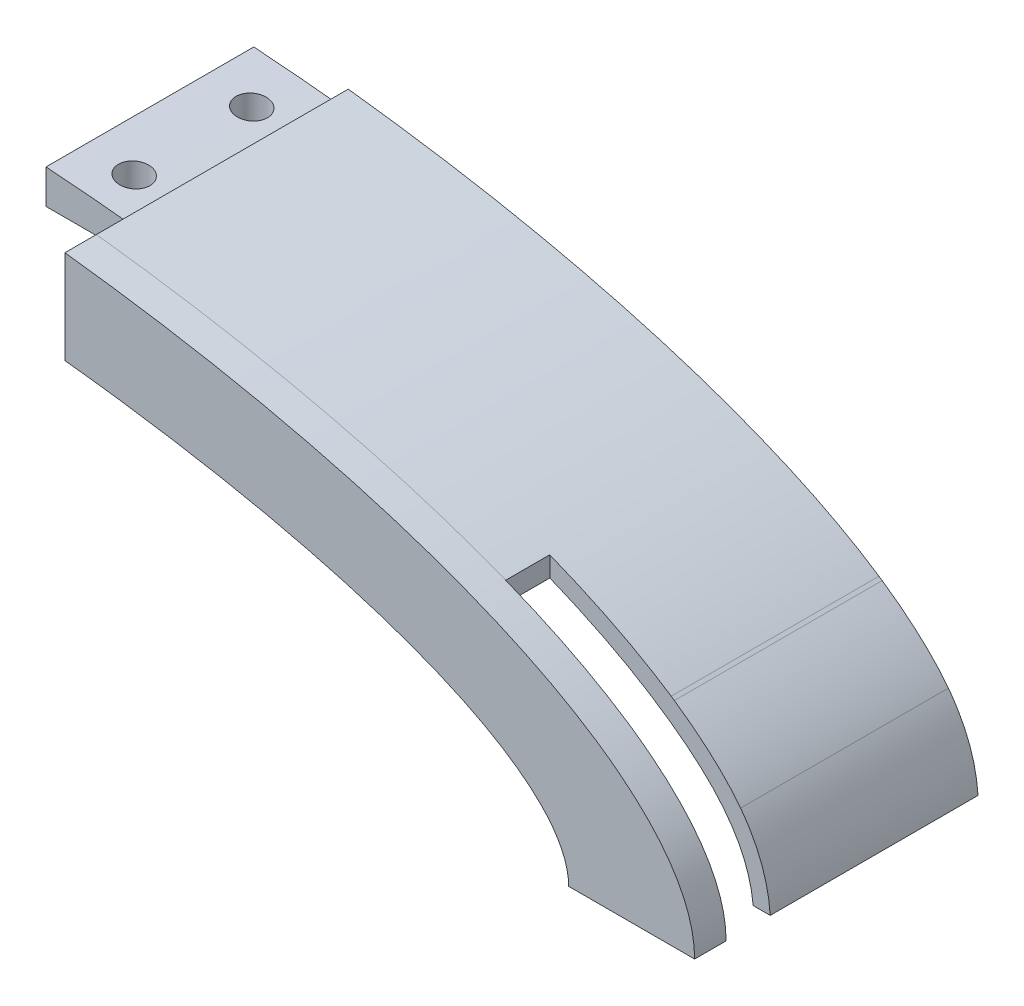
ISO-10303-21;
HEADER;
FILE_DESCRIPTION(('STEP AP214'),'2;1');
FILE_NAME('part.step','',(''),(''),'','','');
FILE_SCHEMA(('AUTOMOTIVE_DESIGN { 1 0 10303 214 1 1 1 1 }'));
ENDSEC;
DATA;
#1=APPLICATION_CONTEXT('core data for automotive mechanical design processes');
#2=APPLICATION_PROTOCOL_DEFINITION('international standard','automotive_design',2000,#1);
#3=PRODUCT_CONTEXT('',#1,'mechanical');
#4=PRODUCT('Part','Part','',(#3));
#5=PRODUCT_RELATED_PRODUCT_CATEGORY('part','',(#4));
#6=PRODUCT_DEFINITION_FORMATION('','',#4);
#7=PRODUCT_DEFINITION_CONTEXT('part definition',#1,'design');
#8=PRODUCT_DEFINITION('design','',#6,#7);
#9=PRODUCT_DEFINITION_SHAPE('','',#8);
#10=(LENGTH_UNIT() NAMED_UNIT(*) SI_UNIT(.MILLI.,.METRE.));
#11=(NAMED_UNIT(*) PLANE_ANGLE_UNIT() SI_UNIT($,.RADIAN.));
#12=(NAMED_UNIT(*) SI_UNIT($,.STERADIAN.) SOLID_ANGLE_UNIT());
#13=UNCERTAINTY_MEASURE_WITH_UNIT(LENGTH_MEASURE(1.E-05),#10,'distance_accuracy_value','');
#14=(GEOMETRIC_REPRESENTATION_CONTEXT(3) GLOBAL_UNCERTAINTY_ASSIGNED_CONTEXT((#13)) GLOBAL_UNIT_ASSIGNED_CONTEXT((#10,
#11,#12)) REPRESENTATION_CONTEXT('',''));
#15=CARTESIAN_POINT('',(0.,0.,0.));
#16=DIRECTION('',(0.,0.,1.));
#17=DIRECTION('',(1.,0.,0.));
#18=AXIS2_PLACEMENT_3D('',#15,#16,#17);
#19=CARTESIAN_POINT('',(50.,0.,0.));
#20=DIRECTION('',(-1.,0.,0.));
#21=DIRECTION('',(0.,-1.,0.));
#22=AXIS2_PLACEMENT_3D('',#19,#20,#21);
#23=PLANE('',#22);
#24=DIRECTION('',(0.,-1.,0.));
#25=VECTOR('',#24,1.);
#26=CARTESIAN_POINT('',(50.,0.,0.));
#27=LINE('',#26,#25);
#28=CARTESIAN_POINT('',(50.0000000000001,44.0928528927283,0.));
#29=VERTEX_POINT('',#28);
#30=CARTESIAN_POINT('',(50.,32.3076923076923,0.));
#31=VERTEX_POINT('',#30);
#32=EDGE_CURVE('E387',#29,#31,#27,.T.);
#33=ORIENTED_EDGE('',*,*,#32,.T.);
#34=DIRECTION('',(0.,0.,1.));
#35=VECTOR('',#34,1.);
#36=CARTESIAN_POINT('',(50.,32.3076923076923,2.5));
#37=LINE('',#36,#35);
#38=CARTESIAN_POINT('',(50.,32.3076923076923,5.));
#39=VERTEX_POINT('',#38);
#40=EDGE_CURVE('E384',#31,#39,#37,.T.);
#41=ORIENTED_EDGE('',*,*,#40,.T.);
#42=DIRECTION('',(0.,-1.,0.));
#43=VECTOR('',#42,1.);
#44=CARTESIAN_POINT('',(50.,0.,5.));
#45=LINE('',#44,#43);
#46=CARTESIAN_POINT('',(50.,47.1404520791032,5.));
#47=VERTEX_POINT('',#46);
#48=EDGE_CURVE('E400',#47,#39,#45,.T.);
#49=ORIENTED_EDGE('',*,*,#48,.F.);
#50=DIRECTION('',(0.,0.,-1.));
#51=VECTOR('',#50,1.);
#52=CARTESIAN_POINT('',(50.,47.1404520791032,5.));
#53=LINE('',#52,#51);
#54=CARTESIAN_POINT('',(50.,47.1404520791032,0.));
#55=VERTEX_POINT('',#54);
#56=EDGE_CURVE('E390',#47,#55,#53,.T.);
#57=ORIENTED_EDGE('',*,*,#56,.T.);
#58=DIRECTION('',(0.,0.,1.));
#59=VECTOR('',#58,1.);
#60=CARTESIAN_POINT('',(50.,47.1404520791032,-40.));
#61=LINE('',#60,#59);
#62=CARTESIAN_POINT('',(50.,47.1404520791032,-40.));
#63=VERTEX_POINT('',#62);
#64=EDGE_CURVE('E397',#55,#63,#61,.F.);
#65=ORIENTED_EDGE('',*,*,#64,.T.);
#66=DIRECTION('',(0.,-1.,0.));
#67=VECTOR('',#66,1.);
#68=CARTESIAN_POINT('',(50.,0.,-40.));
#69=LINE('',#68,#67);
#70=CARTESIAN_POINT('',(50.0000000000001,44.0928528927283,-40.));
#71=VERTEX_POINT('',#70);
#72=EDGE_CURVE('E381',#63,#71,#69,.T.);
#73=ORIENTED_EDGE('',*,*,#72,.T.);
#74=DIRECTION('',(0.,0.,1.));
#75=VECTOR('',#74,1.);
#76=CARTESIAN_POINT('',(50.,44.0928528927283,-40.));
#77=LINE('',#76,#75);
#78=CARTESIAN_POINT('',(50.0000000000001,44.0928528927283,-7.00000000000002));
#79=VERTEX_POINT('',#78);
#80=EDGE_CURVE('E394',#71,#79,#77,.T.);
#81=ORIENTED_EDGE('',*,*,#80,.T.);
#82=EDGE_CURVE('E393',#79,#29,#77,.T.);
#83=ORIENTED_EDGE('',*,*,#82,.T.);
#84=EDGE_LOOP('',(#33,#41,#49,#57,#65,#73,#81,#83));
#85=FACE_BOUND('',#84,.T.);
#86=ADVANCED_FACE('F39',(#85),#23,.T.);
#87=CARTESIAN_POINT('',(150.,50.0005,-7.));
#88=DIRECTION('',(0.,0.,1.));
#89=DIRECTION('',(1.,0.,0.));
#90=AXIS2_PLACEMENT_3D('',#87,#88,#89);
#91=PLANE('',#90);
#92=CARTESIAN_POINT('',(0.,0.,-7.00000000000001));
#93=DIRECTION('',(0.,0.,-1.));
#94=DIRECTION('',(-1.,0.,0.));
#95=AXIS2_PLACEMENT_3D('',#92,#93,#94);
#96=ELLIPSE('',#95,150.,50.);
#97=CARTESIAN_POINT('',(134.274226106668,22.2870969233956,-7.00000000000002));
#98=VERTEX_POINT('',#97);
#99=CARTESIAN_POINT('',(115.,32.1022671404304,-7.));
#100=VERTEX_POINT('',#99);
#101=EDGE_CURVE('E436',#98,#100,#96,.F.);
#102=ORIENTED_EDGE('',*,*,#101,.T.);
#103=DIRECTION('',(0.,-1.,0.));
#104=VECTOR('',#103,1.);
#105=CARTESIAN_POINT('',(115.,50.0005,-7.));
#106=LINE('',#105,#104);
#107=CARTESIAN_POINT('',(115.,28.8998222705045,-7.));
#108=VERTEX_POINT('',#107);
#109=EDGE_CURVE('E326',#100,#108,#106,.T.);
#110=ORIENTED_EDGE('',*,*,#109,.T.);
#111=CARTESIAN_POINT('',(147.297229877736,0.,-7.00000000000002));
#112=CARTESIAN_POINT('',(146.55190637035,8.1210873517637,-7.00000000000002));
#113=CARTESIAN_POINT('',(134.103124610867,20.5937570390856,-7.00000000000002));
#114=CARTESIAN_POINT('',(110.28433455085,31.4682746566878,-7.00000000000002));
#115=CARTESIAN_POINT('',(65.5548375328861,44.1559680318761,-7.00000000000002));
#116=CARTESIAN_POINT('',(27.8686299807415,46.563681344994,-7.00000000000002));
#117=CARTESIAN_POINT('',(0.,46.6002426808814,-7.00000000000002));
#118=B_SPLINE_CURVE_WITH_KNOTS('',3,(#111,#112,#113,#114,#115,#116,#117),.UNSPECIFIED.,.F.,.F.,
(4,1,1,1,4),(0.,0.141743179969019,0.308701525327165,0.483121699978807,1.),.UNSPECIFIED.);
#119=CARTESIAN_POINT('',(147.297229877736,0.,-7.));
#120=VERTEX_POINT('',#119);
#121=EDGE_CURVE('E306',#108,#120,#118,.F.);
#122=ORIENTED_EDGE('',*,*,#121,.T.);
#123=DIRECTION('',(-1.,0.,0.));
#124=VECTOR('',#123,1.);
#125=CARTESIAN_POINT('',(150.,0.,-7.));
#126=LINE('',#125,#124);
#127=CARTESIAN_POINT('',(150.,0.,-7.));
#128=VERTEX_POINT('',#127);
#129=EDGE_CURVE('E11',#128,#120,#126,.T.);
#130=ORIENTED_EDGE('',*,*,#129,.F.);
#131=CARTESIAN_POINT('',(150.,0.,-7.00000000000002));
#132=CARTESIAN_POINT('',(149.366974801961,10.0364415380543,-7.00000000000002));
#133=CARTESIAN_POINT('',(134.490815562498,24.4032961206006,-7.00000000000002));
#134=CARTESIAN_POINT('',(108.511776452667,35.2074679810045,-7.00000000000002));
#135=CARTESIAN_POINT('',(63.6543444537667,47.1037533474138,-7.00000000000002));
#136=CARTESIAN_POINT('',(27.5396604460598,49.9400050182537,-7.00000000000002));
#137=CARTESIAN_POINT('',(5.28874849839181E-13,50.,-7.00000000000002));
#138=B_SPLINE_CURVE_WITH_KNOTS('',3,(#131,#132,#133,#134,#135,#136,#137),.UNSPECIFIED.,.F.,.F.,
(4,1,1,1,4),(0.,0.164934741661339,0.354369831819262,0.50328897730762,1.),.UNSPECIFIED.);
#139=CARTESIAN_POINT('',(145.300907362266,12.4170416932275,-7.00000000000002));
#140=VERTEX_POINT('',#139);
#141=EDGE_CURVE('E301',#140,#128,#138,.F.);
#142=ORIENTED_EDGE('',*,*,#141,.F.);
#143=CARTESIAN_POINT('',(0.,0.,-7.00000000000001));
#144=DIRECTION('',(0.,0.,-1.));
#145=DIRECTION('',(-1.,0.,0.));
#146=AXIS2_PLACEMENT_3D('',#143,#144,#145);
#147=ELLIPSE('',#146,150.,50.);
#148=CARTESIAN_POINT('',(134.779349014432,21.9457084623899,-7.00000000000001));
#149=VERTEX_POINT('',#148);
#150=EDGE_CURVE('E305',#140,#149,#147,.F.);
#151=ORIENTED_EDGE('',*,*,#150,.T.);
#152=CARTESIAN_POINT('',(150.,0.,-7.00000000000002));
#153=CARTESIAN_POINT('',(149.366974801961,10.0364415380543,-7.00000000000002));
#154=CARTESIAN_POINT('',(134.490815562498,24.4032961206006,-7.00000000000002));
#155=CARTESIAN_POINT('',(108.511776452667,35.2074679810045,-7.00000000000002));
#156=CARTESIAN_POINT('',(63.6543444537667,47.1037533474138,-7.00000000000002));
#157=CARTESIAN_POINT('',(27.5396604460598,49.9400050182537,-7.00000000000002));
#158=CARTESIAN_POINT('',(5.28874849839181E-13,50.,-7.00000000000002));
#159=B_SPLINE_CURVE_WITH_KNOTS('',3,(#152,#153,#154,#155,#156,#157,#158),.UNSPECIFIED.,.F.,.F.,
(4,1,1,1,4),(0.,0.164934741661339,0.354369831819262,0.50328897730762,1.),.UNSPECIFIED.);
#160=EDGE_CURVE('E437',#98,#149,#159,.F.);
#161=ORIENTED_EDGE('',*,*,#160,.F.);
#162=EDGE_LOOP('',(#102,#110,#122,#130,#142,#151,#161));
#163=FACE_BOUND('',#162,.T.);
#164=ADVANCED_FACE('F253',(#163),#91,.T.);
#165=CARTESIAN_POINT('',(115.,50.0005,0.));
#166=DIRECTION('',(-1.,0.,0.));
#167=DIRECTION('',(0.,0.,1.));
#168=AXIS2_PLACEMENT_3D('',#165,#166,#167);
#169=PLANE('',#168);
#170=DIRECTION('',(0.,-1.,0.));
#171=VECTOR('',#170,1.);
#172=CARTESIAN_POINT('',(115.,50.0005,0.));
#173=LINE('',#172,#171);
#174=CARTESIAN_POINT('',(115.,32.1022671404304,0.));
#175=VERTEX_POINT('',#174);
#176=CARTESIAN_POINT('',(115.,28.8998222694203,0.));
#177=VERTEX_POINT('',#176);
#178=EDGE_CURVE('E49',#175,#177,#173,.T.);
#179=ORIENTED_EDGE('',*,*,#178,.T.);
#180=DIRECTION('',(0.,0.,1.));
#181=VECTOR('',#180,1.);
#182=CARTESIAN_POINT('',(115.,28.8998222705045,-40.));
#183=LINE('',#182,#181);
#184=EDGE_CURVE('E470',#108,#177,#183,.T.);
#185=ORIENTED_EDGE('',*,*,#184,.F.);
#186=ORIENTED_EDGE('',*,*,#109,.F.);
#187=DIRECTION('',(0.,0.,1.));
#188=VECTOR('',#187,1.);
#189=CARTESIAN_POINT('',(115.,32.1022671404304,-40.));
#190=LINE('',#189,#188);
#191=EDGE_CURVE('E304',#175,#100,#190,.F.);
#192=ORIENTED_EDGE('',*,*,#191,.F.);
#193=EDGE_LOOP('',(#179,#185,#186,#192));
#194=FACE_BOUND('',#193,.T.);
#195=ADVANCED_FACE('F255',(#194),#169,.F.);
#196=CARTESIAN_POINT('',(147.297229877736,0.,-40.));
#197=CARTESIAN_POINT('',(146.55190637035,8.1210873517637,-40.));
#198=CARTESIAN_POINT('',(134.103124610867,20.5937570390856,-40.));
#199=CARTESIAN_POINT('',(110.28433455085,31.4682746566878,-40.));
#200=CARTESIAN_POINT('',(65.5548375328861,44.1559680318761,-40.));
#201=CARTESIAN_POINT('',(27.8686299807415,46.563681344994,-40.));
#202=CARTESIAN_POINT('',(0.,46.6002426808814,-40.));
#203=B_SPLINE_CURVE_WITH_KNOTS('',3,(#196,#197,#198,#199,#200,#201,#202),.UNSPECIFIED.,.F.,.F.,
(4,1,1,1,4),(0.,0.141743179969019,0.308701525327165,0.483121699978807,1.),.UNSPECIFIED.);
#204=DIRECTION('',(0.,0.,1.));
#205=VECTOR('',#204,1.);
#206=SURFACE_OF_LINEAR_EXTRUSION('',#203,#205);
#207=ORIENTED_EDGE('',*,*,#82,.F.);
#208=CARTESIAN_POINT('',(147.297229877736,0.,-7.00000000000002));
#209=CARTESIAN_POINT('',(146.55190637035,8.1210873517637,-7.00000000000002));
#210=CARTESIAN_POINT('',(134.103124610867,20.5937570390856,-7.00000000000002));
#211=CARTESIAN_POINT('',(110.28433455085,31.4682746566878,-7.00000000000002));
#212=CARTESIAN_POINT('',(65.5548375328861,44.1559680318761,-7.00000000000002));
#213=CARTESIAN_POINT('',(27.8686299807415,46.563681344994,-7.00000000000002));
#214=CARTESIAN_POINT('',(0.,46.6002426808814,-7.00000000000002));
#215=B_SPLINE_CURVE_WITH_KNOTS('',3,(#208,#209,#210,#211,#212,#213,#214),.UNSPECIFIED.,.F.,.F.,
(4,1,1,1,4),(0.,0.141743179969019,0.308701525327165,0.483121699978807,1.),.UNSPECIFIED.);
#216=CARTESIAN_POINT('',(65.0000000000011,42.0902168247644,-7.00000000000002));
#217=VERTEX_POINT('',#216);
#218=EDGE_CURVE('E213',#217,#79,#215,.T.);
#219=ORIENTED_EDGE('',*,*,#218,.F.);
#220=DIRECTION('',(0.,0.,1.));
#221=VECTOR('',#220,1.);
#222=CARTESIAN_POINT('',(65.,42.0902168247645,-40.));
#223=LINE('',#222,#221);
#224=CARTESIAN_POINT('',(65.0000000000011,42.0902168247644,-40.));
#225=VERTEX_POINT('',#224);
#226=EDGE_CURVE('E178',#225,#217,#223,.T.);
#227=ORIENTED_EDGE('',*,*,#226,.F.);
#228=CARTESIAN_POINT('',(147.297229877736,0.,-40.));
#229=VERTEX_POINT('',#228);
#230=EDGE_CURVE('E334',#229,#225,#203,.T.);
#231=ORIENTED_EDGE('',*,*,#230,.F.);
#232=DIRECTION('',(0.,0.,1.));
#233=VECTOR('',#232,1.);
#234=CARTESIAN_POINT('',(147.297229877736,0.,-40.));
#235=LINE('',#234,#233);
#236=EDGE_CURVE('E424',#229,#120,#235,.T.);
#237=ORIENTED_EDGE('',*,*,#236,.T.);
#238=ORIENTED_EDGE('',*,*,#121,.F.);
#239=ORIENTED_EDGE('',*,*,#184,.T.);
#240=CARTESIAN_POINT('',(147.297229877736,0.,0.));
#241=CARTESIAN_POINT('',(146.55190637035,8.1210873517637,0.));
#242=CARTESIAN_POINT('',(134.103124610867,20.5937570390856,0.));
#243=CARTESIAN_POINT('',(110.28433455085,31.4682746566878,0.));
#244=CARTESIAN_POINT('',(65.5548375328861,44.1559680318761,0.));
#245=CARTESIAN_POINT('',(27.8686299807415,46.563681344994,0.));
#246=CARTESIAN_POINT('',(0.,46.6002426808814,0.));
#247=B_SPLINE_CURVE_WITH_KNOTS('',3,(#240,#241,#242,#243,#244,#245,#246),.UNSPECIFIED.,.F.,.F.,
(4,1,1,1,4),(0.,0.141743179969019,0.308701525327165,0.483121699978807,1.),.UNSPECIFIED.);
#248=EDGE_CURVE('E433',#177,#29,#247,.T.);
#249=ORIENTED_EDGE('',*,*,#248,.T.);
#250=EDGE_LOOP('',(#207,#219,#227,#231,#237,#238,#239,#249));
#251=FACE_BOUND('',#250,.T.);
#252=ADVANCED_FACE('F261',(#251),#206,.F.);
#253=CARTESIAN_POINT('',(-172.714644282662,0.,-343.285055293836));
#254=DIRECTION('',(0.,1.,0.));
#255=DIRECTION('',(0.,0.,1.));
#256=AXIS2_PLACEMENT_3D('',#253,#254,#255);
#257=PLANE('',#256);
#258=ORIENTED_EDGE('',*,*,#129,.T.);
#259=ORIENTED_EDGE('',*,*,#236,.F.);
#260=DIRECTION('',(-1.,0.,0.));
#261=VECTOR('',#260,1.);
#262=CARTESIAN_POINT('',(0.,0.,-40.));
#263=LINE('',#262,#261);
#264=CARTESIAN_POINT('',(150.,0.,-40.));
#265=VERTEX_POINT('',#264);
#266=EDGE_CURVE('E369',#265,#229,#263,.T.);
#267=ORIENTED_EDGE('',*,*,#266,.F.);
#268=DIRECTION('',(0.,0.,1.));
#269=VECTOR('',#268,1.);
#270=CARTESIAN_POINT('',(150.,0.,-40.));
#271=LINE('',#270,#269);
#272=EDGE_CURVE('E341',#265,#128,#271,.T.);
#273=ORIENTED_EDGE('',*,*,#272,.T.);
#274=EDGE_LOOP('',(#258,#259,#267,#273));
#275=FACE_BOUND('',#274,.T.);
#276=ADVANCED_FACE('F268',(#275),#257,.F.);
#277=CARTESIAN_POINT('',(150.,0.,-40.));
#278=CARTESIAN_POINT('',(149.366974801961,10.0364415380543,-40.));
#279=CARTESIAN_POINT('',(134.490815562498,24.4032961206006,-40.));
#280=CARTESIAN_POINT('',(108.511776452667,35.2074679810045,-40.));
#281=CARTESIAN_POINT('',(63.6543444537667,47.1037533474138,-40.));
#282=CARTESIAN_POINT('',(27.5396604460598,49.9400050182537,-40.));
#283=CARTESIAN_POINT('',(5.28874849839181E-13,50.,-40.));
#284=B_SPLINE_CURVE_WITH_KNOTS('',3,(#277,#278,#279,#280,#281,#282,#283),.UNSPECIFIED.,.F.,.F.,
(4,1,1,1,4),(0.,0.164934741661339,0.354369831819262,0.50328897730762,1.),.UNSPECIFIED.);
#285=DIRECTION('',(0.,0.,1.));
#286=VECTOR('',#285,1.);
#287=SURFACE_OF_LINEAR_EXTRUSION('',#284,#286);
#288=DIRECTION('',(0.,0.,1.));
#289=VECTOR('',#288,1.);
#290=CARTESIAN_POINT('',(145.300907362266,12.4170416932275,-40.));
#291=LINE('',#290,#289);
#292=CARTESIAN_POINT('',(145.300907362266,12.4170416932275,-40.));
#293=VERTEX_POINT('',#292);
#294=EDGE_CURVE('E451',#293,#140,#291,.T.);
#295=ORIENTED_EDGE('',*,*,#294,.T.);
#296=ORIENTED_EDGE('',*,*,#141,.T.);
#297=ORIENTED_EDGE('',*,*,#272,.F.);
#298=EDGE_CURVE('E363',#265,#293,#284,.T.);
#299=ORIENTED_EDGE('',*,*,#298,.T.);
#300=EDGE_LOOP('',(#295,#296,#297,#299));
#301=FACE_BOUND('',#300,.T.);
#302=ADVANCED_FACE('F270',(#301),#287,.T.);
#303=CARTESIAN_POINT('',(0.,0.,-40.));
#304=DIRECTION('',(0.,0.,-1.));
#305=DIRECTION('',(-1.,0.,0.));
#306=AXIS2_PLACEMENT_3D('',#303,#304,#305);
#307=ELLIPSE('',#306,150.,50.);
#308=DIRECTION('',(0.,0.,1.));
#309=VECTOR('',#308,1.);
#310=SURFACE_OF_LINEAR_EXTRUSION('',#307,#309);
#311=ORIENTED_EDGE('',*,*,#150,.F.);
#312=ORIENTED_EDGE('',*,*,#294,.F.);
#313=CARTESIAN_POINT('',(134.779349014432,21.9457084623899,-40.));
#314=VERTEX_POINT('',#313);
#315=EDGE_CURVE('E342',#314,#293,#307,.T.);
#316=ORIENTED_EDGE('',*,*,#315,.F.);
#317=DIRECTION('',(0.,0.,1.));
#318=VECTOR('',#317,1.);
#319=CARTESIAN_POINT('',(134.779349014432,21.9457084623899,-40.));
#320=LINE('',#319,#318);
#321=EDGE_CURVE('E423',#314,#149,#320,.T.);
#322=ORIENTED_EDGE('',*,*,#321,.T.);
#323=EDGE_LOOP('',(#311,#312,#316,#322));
#324=FACE_BOUND('',#323,.T.);
#325=ADVANCED_FACE('F356',(#324),#310,.F.);
#326=DIRECTION('',(0.,0.,1.));
#327=VECTOR('',#326,1.);
#328=CARTESIAN_POINT('',(134.274226106668,22.2870969233957,-40.));
#329=LINE('',#328,#327);
#330=CARTESIAN_POINT('',(134.274226106668,22.2870969233957,-40.));
#331=VERTEX_POINT('',#330);
#332=EDGE_CURVE('E419',#331,#98,#329,.T.);
#333=ORIENTED_EDGE('',*,*,#332,.T.);
#334=ORIENTED_EDGE('',*,*,#160,.T.);
#335=ORIENTED_EDGE('',*,*,#321,.F.);
#336=EDGE_CURVE('E370',#314,#331,#284,.T.);
#337=ORIENTED_EDGE('',*,*,#336,.T.);
#338=EDGE_LOOP('',(#333,#334,#335,#337));
#339=FACE_BOUND('',#338,.T.);
#340=ADVANCED_FACE('F354',(#339),#287,.T.);
#341=ORIENTED_EDGE('',*,*,#64,.F.);
#342=CARTESIAN_POINT('',(0.,0.,0.));
#343=DIRECTION('',(0.,0.,-1.));
#344=DIRECTION('',(-1.,0.,0.));
#345=AXIS2_PLACEMENT_3D('',#342,#343,#344);
#346=ELLIPSE('',#345,150.,50.);
#347=EDGE_CURVE('E331',#55,#175,#346,.T.);
#348=ORIENTED_EDGE('',*,*,#347,.T.);
#349=ORIENTED_EDGE('',*,*,#191,.T.);
#350=ORIENTED_EDGE('',*,*,#101,.F.);
#351=ORIENTED_EDGE('',*,*,#332,.F.);
#352=EDGE_CURVE('E340',#63,#331,#307,.T.);
#353=ORIENTED_EDGE('',*,*,#352,.F.);
#354=EDGE_LOOP('',(#341,#348,#349,#350,#351,#353));
#355=FACE_BOUND('',#354,.T.);
#356=ADVANCED_FACE('F351',(#355),#310,.F.);
#357=CARTESIAN_POINT('',(0.,0.,-40.));
#358=DIRECTION('',(0.,0.,1.));
#359=DIRECTION('',(1.,0.,0.));
#360=AXIS2_PLACEMENT_3D('',#357,#358,#359);
#361=PLANE('',#360);
#362=ORIENTED_EDGE('',*,*,#72,.F.);
#363=ORIENTED_EDGE('',*,*,#352,.T.);
#364=ORIENTED_EDGE('',*,*,#336,.F.);
#365=ORIENTED_EDGE('',*,*,#315,.T.);
#366=ORIENTED_EDGE('',*,*,#298,.F.);
#367=ORIENTED_EDGE('',*,*,#266,.T.);
#368=ORIENTED_EDGE('',*,*,#230,.T.);
#369=DIRECTION('',(0.,-1.,0.));
#370=VECTOR('',#369,1.);
#371=CARTESIAN_POINT('',(65.,50.0015,-40.));
#372=LINE('',#371,#370);
#373=CARTESIAN_POINT('',(65.,40.,-40.));
#374=VERTEX_POINT('',#373);
#375=EDGE_CURVE('E207',#225,#374,#372,.T.);
#376=ORIENTED_EDGE('',*,*,#375,.T.);
#377=DIRECTION('',(-1.,0.,0.));
#378=VECTOR('',#377,1.);
#379=CARTESIAN_POINT('',(65.,40.,-40.));
#380=LINE('',#379,#378);
#381=CARTESIAN_POINT('',(35.,40.,-40.));
#382=VERTEX_POINT('',#381);
#383=EDGE_CURVE('E183',#374,#382,#380,.T.);
#384=ORIENTED_EDGE('',*,*,#383,.T.);
#385=DIRECTION('',(0.,-1.,0.));
#386=VECTOR('',#385,1.);
#387=CARTESIAN_POINT('',(35.,50.0015,-40.));
#388=LINE('',#387,#386);
#389=CARTESIAN_POINT('',(35.,45.4411229775928,-40.));
#390=VERTEX_POINT('',#389);
#391=EDGE_CURVE('E210',#390,#382,#388,.T.);
#392=ORIENTED_EDGE('',*,*,#391,.F.);
#393=CARTESIAN_POINT('',(147.297229877736,0.,-40.));
#394=CARTESIAN_POINT('',(146.55190637035,8.1210873517637,-40.));
#395=CARTESIAN_POINT('',(134.103124610867,20.5937570390856,-40.));
#396=CARTESIAN_POINT('',(110.28433455085,31.4682746566878,-40.));
#397=CARTESIAN_POINT('',(65.5548375328861,44.1559680318761,-40.));
#398=CARTESIAN_POINT('',(27.8686299807415,46.563681344994,-40.));
#399=CARTESIAN_POINT('',(0.,46.6002426808814,-40.));
#400=B_SPLINE_CURVE_WITH_KNOTS('',3,(#393,#394,#395,#396,#397,#398,#399),.UNSPECIFIED.,.F.,.F.,
(4,1,1,1,4),(0.,0.141743179969019,0.308701525327165,0.483121699978807,1.),.UNSPECIFIED.);
#401=EDGE_CURVE('E218',#71,#390,#400,.T.);
#402=ORIENTED_EDGE('',*,*,#401,.F.);
#403=EDGE_LOOP('',(#362,#363,#364,#365,#366,#367,#368,#376,#384,#392,#402));
#404=FACE_BOUND('',#403,.T.);
#405=ADVANCED_FACE('F278',(#404),#361,.F.);
#406=CARTESIAN_POINT('',(0.,0.,0.));
#407=DIRECTION('',(0.,0.,1.));
#408=DIRECTION('',(1.,0.,0.));
#409=AXIS2_PLACEMENT_3D('',#406,#407,#408);
#410=PLANE('',#409);
#411=ORIENTED_EDGE('',*,*,#32,.F.);
#412=ORIENTED_EDGE('',*,*,#248,.F.);
#413=ORIENTED_EDGE('',*,*,#178,.F.);
#414=CARTESIAN_POINT('',(0.,0.,0.));
#415=DIRECTION('',(0.,0.,-1.));
#416=DIRECTION('',(-1.,0.,0.));
#417=AXIS2_PLACEMENT_3D('',#414,#415,#416);
#418=ELLIPSE('',#417,150.,50.);
#419=CARTESIAN_POINT('',(134.274226106667,22.2870969233956,0.));
#420=VERTEX_POINT('',#419);
#421=EDGE_CURVE('E321',#420,#175,#418,.F.);
#422=ORIENTED_EDGE('',*,*,#421,.F.);
#423=CARTESIAN_POINT('',(0.,0.,0.));
#424=DIRECTION('',(0.,0.,1.));
#425=DIRECTION('',(1.,0.,0.));
#426=AXIS2_PLACEMENT_3D('',#423,#424,#425);
#427=ELLIPSE('',#426,150.,50.);
#428=CARTESIAN_POINT('',(134.779349014432,21.9457084623899,0.));
#429=VERTEX_POINT('',#428);
#430=EDGE_CURVE('E298',#429,#420,#427,.T.);
#431=ORIENTED_EDGE('',*,*,#430,.F.);
#432=CARTESIAN_POINT('',(0.,0.,0.));
#433=DIRECTION('',(0.,0.,1.));
#434=DIRECTION('',(1.,0.,0.));
#435=AXIS2_PLACEMENT_3D('',#432,#433,#434);
#436=ELLIPSE('',#435,150.,50.);
#437=CARTESIAN_POINT('',(150.,0.,0.));
#438=VERTEX_POINT('',#437);
#439=EDGE_CURVE('E380',#438,#429,#436,.T.);
#440=ORIENTED_EDGE('',*,*,#439,.F.);
#441=DIRECTION('',(1.,0.,0.));
#442=VECTOR('',#441,1.);
#443=CARTESIAN_POINT('',(-172.714644282662,0.,0.));
#444=LINE('',#443,#442);
#445=CARTESIAN_POINT('',(130.,0.,0.));
#446=VERTEX_POINT('',#445);
#447=EDGE_CURVE('E57',#446,#438,#444,.T.);
#448=ORIENTED_EDGE('',*,*,#447,.F.);
#449=CARTESIAN_POINT('',(0.,0.,0.));
#450=DIRECTION('',(0.,0.,1.));
#451=DIRECTION('',(1.,0.,0.));
#452=AXIS2_PLACEMENT_3D('',#449,#450,#451);
#453=ELLIPSE('',#452,130.,35.);
#454=EDGE_CURVE('E378',#31,#446,#453,.F.);
#455=ORIENTED_EDGE('',*,*,#454,.F.);
#456=EDGE_LOOP('',(#411,#412,#413,#422,#431,#440,#448,#455));
#457=FACE_BOUND('',#456,.T.);
#458=ADVANCED_FACE('F274',(#457),#410,.F.);
#459=ORIENTED_EDGE('',*,*,#447,.T.);
#460=DIRECTION('',(0.,0.,-1.));
#461=VECTOR('',#460,1.);
#462=CARTESIAN_POINT('',(150.,0.,5.));
#463=LINE('',#462,#461);
#464=CARTESIAN_POINT('',(150.,0.,5.));
#465=VERTEX_POINT('',#464);
#466=EDGE_CURVE('E377',#465,#438,#463,.T.);
#467=ORIENTED_EDGE('',*,*,#466,.F.);
#468=DIRECTION('',(-1.,0.,0.));
#469=VECTOR('',#468,1.);
#470=CARTESIAN_POINT('',(-172.714644282662,0.,5.));
#471=LINE('',#470,#469);
#472=CARTESIAN_POINT('',(130.,0.,5.));
#473=VERTEX_POINT('',#472);
#474=EDGE_CURVE('E330',#465,#473,#471,.T.);
#475=ORIENTED_EDGE('',*,*,#474,.T.);
#476=DIRECTION('',(0.,0.,1.));
#477=VECTOR('',#476,1.);
#478=CARTESIAN_POINT('',(130.,0.,2.5));
#479=LINE('',#478,#477);
#480=EDGE_CURVE('E414',#446,#473,#479,.T.);
#481=ORIENTED_EDGE('',*,*,#480,.F.);
#482=EDGE_LOOP('',(#459,#467,#475,#481));
#483=FACE_BOUND('',#482,.T.);
#484=ADVANCED_FACE('F272',(#483),#257,.F.);
#485=CARTESIAN_POINT('',(0.,0.,-269.258240356725));
#486=DIRECTION('',(0.,0.,1.));
#487=DIRECTION('',(1.,0.,0.));
#488=AXIS2_PLACEMENT_3D('',#485,#486,#487);
#489=ELLIPSE('',#488,130.,35.);
#490=DIRECTION('',(0.,0.,1.));
#491=VECTOR('',#490,1.);
#492=SURFACE_OF_LINEAR_EXTRUSION('',#489,#491);
#493=ORIENTED_EDGE('',*,*,#40,.F.);
#494=ORIENTED_EDGE('',*,*,#454,.T.);
#495=ORIENTED_EDGE('',*,*,#480,.T.);
#496=CARTESIAN_POINT('',(0.,0.,5.));
#497=DIRECTION('',(0.,0.,1.));
#498=DIRECTION('',(1.,0.,0.));
#499=AXIS2_PLACEMENT_3D('',#496,#497,#498);
#500=ELLIPSE('',#499,130.,35.);
#501=EDGE_CURVE('E371',#473,#39,#500,.T.);
#502=ORIENTED_EDGE('',*,*,#501,.T.);
#503=EDGE_LOOP('',(#493,#494,#495,#502));
#504=FACE_BOUND('',#503,.T.);
#505=ADVANCED_FACE('F280',(#504),#492,.F.);
#506=CARTESIAN_POINT('',(0.,0.,5.));
#507=DIRECTION('',(0.,0.,1.));
#508=DIRECTION('',(1.,0.,0.));
#509=AXIS2_PLACEMENT_3D('',#506,#507,#508);
#510=ELLIPSE('',#509,150.,50.);
#511=DIRECTION('',(0.,0.,-1.));
#512=VECTOR('',#511,1.);
#513=SURFACE_OF_LINEAR_EXTRUSION('',#510,#512);
#514=ORIENTED_EDGE('',*,*,#56,.F.);
#515=CARTESIAN_POINT('',(134.274226106553,22.2870969234726,5.));
#516=VERTEX_POINT('',#515);
#517=EDGE_CURVE('E413',#516,#47,#510,.T.);
#518=ORIENTED_EDGE('',*,*,#517,.F.);
#519=CARTESIAN_POINT('',(0.,0.,5.));
#520=DIRECTION('',(0.,0.,-1.));
#521=DIRECTION('',(1.,0.,0.));
#522=AXIS2_PLACEMENT_3D('',#519,#520,#521);
#523=ELLIPSE('',#522,150.,50.);
#524=CARTESIAN_POINT('',(134.779349014432,21.9457084623899,5.));
#525=VERTEX_POINT('',#524);
#526=EDGE_CURVE('E418',#525,#516,#523,.F.);
#527=ORIENTED_EDGE('',*,*,#526,.F.);
#528=EDGE_CURVE('E411',#465,#525,#510,.T.);
#529=ORIENTED_EDGE('',*,*,#528,.F.);
#530=ORIENTED_EDGE('',*,*,#466,.T.);
#531=ORIENTED_EDGE('',*,*,#439,.T.);
#532=ORIENTED_EDGE('',*,*,#430,.T.);
#533=ORIENTED_EDGE('',*,*,#421,.T.);
#534=ORIENTED_EDGE('',*,*,#347,.F.);
#535=EDGE_LOOP('',(#514,#518,#527,#529,#530,#531,#532,#533,#534));
#536=FACE_BOUND('',#535,.T.);
#537=ADVANCED_FACE('F360',(#536),#513,.F.);
#538=CARTESIAN_POINT('',(0.,0.,5.));
#539=DIRECTION('',(0.,0.,1.));
#540=DIRECTION('',(1.,0.,0.));
#541=AXIS2_PLACEMENT_3D('',#538,#539,#540);
#542=PLANE('',#541);
#543=ORIENTED_EDGE('',*,*,#517,.T.);
#544=ORIENTED_EDGE('',*,*,#48,.T.);
#545=ORIENTED_EDGE('',*,*,#501,.F.);
#546=ORIENTED_EDGE('',*,*,#474,.F.);
#547=ORIENTED_EDGE('',*,*,#528,.T.);
#548=ORIENTED_EDGE('',*,*,#526,.T.);
#549=EDGE_LOOP('',(#543,#544,#545,#546,#547,#548));
#550=FACE_BOUND('',#549,.T.);
#551=ADVANCED_FACE('F41',(#550),#542,.T.);
#552=CARTESIAN_POINT('',(0.,40.,0.));
#553=DIRECTION('',(0.,-1.,0.));
#554=DIRECTION('',(0.,0.,-1.));
#555=AXIS2_PLACEMENT_3D('',#552,#553,#554);
#556=PLANE('',#555);
#557=CARTESIAN_POINT('',(42.5,40.,-13.5));
#558=DIRECTION('',(0.,-1.,0.));
#559=DIRECTION('',(0.,0.,-1.));
#560=AXIS2_PLACEMENT_3D('',#557,#558,#559);
#561=CIRCLE('',#560,2.5);
#562=CARTESIAN_POINT('',(42.5,40.,-16.));
#563=VERTEX_POINT('',#562);
#564=EDGE_CURVE('E233',#563,#563,#561,.T.);
#565=ORIENTED_EDGE('',*,*,#564,.F.);
#566=EDGE_LOOP('',(#565));
#567=FACE_BOUND('',#566,.T.);
#568=CARTESIAN_POINT('',(42.5,40.,-32.1657372772675));
#569=DIRECTION('',(0.,-1.,0.));
#570=DIRECTION('',(0.,0.,-1.));
#571=AXIS2_PLACEMENT_3D('',#568,#569,#570);
#572=CIRCLE('',#571,2.5);
#573=CARTESIAN_POINT('',(42.5,40.,-34.6657372772675));
#574=VERTEX_POINT('',#573);
#575=EDGE_CURVE('E542',#574,#574,#572,.T.);
#576=ORIENTED_EDGE('',*,*,#575,.F.);
#577=EDGE_LOOP('',(#576));
#578=FACE_BOUND('',#577,.T.);
#579=DIRECTION('',(0.,0.,1.));
#580=VECTOR('',#579,1.);
#581=CARTESIAN_POINT('',(65.,40.,-40.));
#582=LINE('',#581,#580);
#583=CARTESIAN_POINT('',(65.,40.,-7.));
#584=VERTEX_POINT('',#583);
#585=EDGE_CURVE('E176',#374,#584,#582,.T.);
#586=ORIENTED_EDGE('',*,*,#585,.T.);
#587=DIRECTION('',(-1.,0.,0.));
#588=VECTOR('',#587,1.);
#589=CARTESIAN_POINT('',(65.,40.,-7.));
#590=LINE('',#589,#588);
#591=CARTESIAN_POINT('',(35.,40.,-7.));
#592=VERTEX_POINT('',#591);
#593=EDGE_CURVE('E186',#584,#592,#590,.T.);
#594=ORIENTED_EDGE('',*,*,#593,.T.);
#595=DIRECTION('',(0.,0.,1.));
#596=VECTOR('',#595,1.);
#597=CARTESIAN_POINT('',(35.,40.,-40.));
#598=LINE('',#597,#596);
#599=EDGE_CURVE('E192',#382,#592,#598,.T.);
#600=ORIENTED_EDGE('',*,*,#599,.F.);
#601=ORIENTED_EDGE('',*,*,#383,.F.);
#602=EDGE_LOOP('',(#586,#594,#600,#601));
#603=FACE_BOUND('',#602,.T.);
#604=ADVANCED_FACE('F195',(#567,#578,#603),#556,.T.);
#605=CARTESIAN_POINT('',(65.,50.0015,-7.));
#606=DIRECTION('',(0.,0.,1.));
#607=DIRECTION('',(1.,0.,0.));
#608=AXIS2_PLACEMENT_3D('',#605,#606,#607);
#609=PLANE('',#608);
#610=DIRECTION('',(0.,-1.,0.));
#611=VECTOR('',#610,1.);
#612=CARTESIAN_POINT('',(65.,50.0015,-7.));
#613=LINE('',#612,#611);
#614=EDGE_CURVE('E172',#217,#584,#613,.T.);
#615=ORIENTED_EDGE('',*,*,#614,.F.);
#616=ORIENTED_EDGE('',*,*,#218,.T.);
#617=CARTESIAN_POINT('',(35.,45.4411229775928,-7.));
#618=VERTEX_POINT('',#617);
#619=EDGE_CURVE('E209',#79,#618,#215,.T.);
#620=ORIENTED_EDGE('',*,*,#619,.T.);
#621=DIRECTION('',(0.,-1.,0.));
#622=VECTOR('',#621,1.);
#623=CARTESIAN_POINT('',(35.,50.0015,-7.));
#624=LINE('',#623,#622);
#625=EDGE_CURVE('E182',#618,#592,#624,.T.);
#626=ORIENTED_EDGE('',*,*,#625,.T.);
#627=ORIENTED_EDGE('',*,*,#593,.F.);
#628=EDGE_LOOP('',(#615,#616,#620,#626,#627));
#629=FACE_BOUND('',#628,.T.);
#630=ADVANCED_FACE('F187',(#629),#609,.T.);
#631=CARTESIAN_POINT('',(35.,50.0015,-40.));
#632=DIRECTION('',(1.,0.,0.));
#633=DIRECTION('',(0.,0.,-1.));
#634=AXIS2_PLACEMENT_3D('',#631,#632,#633);
#635=PLANE('',#634);
#636=DIRECTION('',(0.,0.,1.));
#637=VECTOR('',#636,1.);
#638=CARTESIAN_POINT('',(35.,45.4411229775928,-40.));
#639=LINE('',#638,#637);
#640=EDGE_CURVE('E217',#390,#618,#639,.T.);
#641=ORIENTED_EDGE('',*,*,#640,.F.);
#642=ORIENTED_EDGE('',*,*,#391,.T.);
#643=ORIENTED_EDGE('',*,*,#599,.T.);
#644=ORIENTED_EDGE('',*,*,#625,.F.);
#645=EDGE_LOOP('',(#641,#642,#643,#644));
#646=FACE_BOUND('',#645,.T.);
#647=ADVANCED_FACE('F523',(#646),#635,.F.);
#648=CARTESIAN_POINT('',(65.,50.0015,-40.));
#649=DIRECTION('',(1.,0.,0.));
#650=DIRECTION('',(0.,0.,-1.));
#651=AXIS2_PLACEMENT_3D('',#648,#649,#650);
#652=PLANE('',#651);
#653=ORIENTED_EDGE('',*,*,#375,.F.);
#654=ORIENTED_EDGE('',*,*,#226,.T.);
#655=ORIENTED_EDGE('',*,*,#614,.T.);
#656=ORIENTED_EDGE('',*,*,#585,.F.);
#657=EDGE_LOOP('',(#653,#654,#655,#656));
#658=FACE_BOUND('',#657,.T.);
#659=ADVANCED_FACE('F174',(#658),#652,.T.);
#660=CARTESIAN_POINT('',(147.297229877736,0.,-40.));
#661=CARTESIAN_POINT('',(146.55190637035,8.1210873517637,-40.));
#662=CARTESIAN_POINT('',(134.103124610867,20.5937570390856,-40.));
#663=CARTESIAN_POINT('',(110.28433455085,31.4682746566878,-40.));
#664=CARTESIAN_POINT('',(65.5548375328861,44.1559680318761,-40.));
#665=CARTESIAN_POINT('',(27.8686299807415,46.563681344994,-40.));
#666=CARTESIAN_POINT('',(0.,46.6002426808814,-40.));
#667=B_SPLINE_CURVE_WITH_KNOTS('',3,(#660,#661,#662,#663,#664,#665,#666),.UNSPECIFIED.,.F.,.F.,
(4,1,1,1,4),(0.,0.141743179969019,0.308701525327165,0.483121699978807,1.),.UNSPECIFIED.);
#668=DIRECTION('',(0.,0.,1.));
#669=VECTOR('',#668,1.);
#670=SURFACE_OF_LINEAR_EXTRUSION('',#667,#669);
#671=CARTESIAN_POINT('',(42.5,44.8421955681182,-16.));
#672=CARTESIAN_POINT('',(42.3592084155711,44.854810754203,-15.9999938328833));
#673=CARTESIAN_POINT('',(42.2183081408641,44.8673555728007,-15.9880675746695));
#674=CARTESIAN_POINT('',(41.9403662018676,44.8919482755418,-15.9406413046343));
#675=CARTESIAN_POINT('',(41.8033293574308,44.9039955469793,-15.9051130965354));
#676=CARTESIAN_POINT('',(41.5371741444046,44.927256146879,-15.8114610184666));
#677=CARTESIAN_POINT('',(41.4080528132948,44.9384697876806,-15.7533456626511));
#678=CARTESIAN_POINT('',(41.1614156893354,44.9597734126804,-15.6161527799869));
#679=CARTESIAN_POINT('',(41.043896939423,44.9698636832677,-15.5370806132703));
#680=CARTESIAN_POINT('',(40.824014043165,44.9886533526824,-15.3603568091622));
#681=CARTESIAN_POINT('',(40.7216217045855,44.9973553414388,-15.2627405306962));
#682=CARTESIAN_POINT('',(40.534682207297,45.0131800835056,-15.0515828693061));
#683=CARTESIAN_POINT('',(40.4501354360735,45.0203028025251,-14.9380411406777));
#684=CARTESIAN_POINT('',(40.3016144935617,45.0327773799757,-14.6986938840975));
#685=CARTESIAN_POINT('',(40.237567935061,45.0381354713727,-14.572933598456));
#686=CARTESIAN_POINT('',(40.1314955482161,45.0469918392935,-14.3123852016733));
#687=CARTESIAN_POINT('',(40.0894692731455,45.0504901535466,-14.1775972737386));
#688=CARTESIAN_POINT('',(40.0287527327147,45.0555397736988,-13.9032559967247));
#689=CARTESIAN_POINT('',(40.0099925827539,45.0570969103982,-13.7637182185474));
#690=CARTESIAN_POINT('',(39.9961211051607,45.0582485428228,-13.4834649159491));
#691=CARTESIAN_POINT('',(40.001009484644,45.0578430628548,-13.3427494061358));
#692=CARTESIAN_POINT('',(40.034268932439,45.0550805490207,-13.0643428085923));
#693=CARTESIAN_POINT('',(40.0626070353608,45.052726254777,-12.9266477535143));
#694=CARTESIAN_POINT('',(40.1419028897079,45.0461225378793,-12.6579812911401));
#695=CARTESIAN_POINT('',(40.1928606652941,45.0418731132012,-12.5270098910258));
#696=CARTESIAN_POINT('',(40.3159667297244,45.031572139904,-12.2754076552474));
#697=CARTESIAN_POINT('',(40.3881289804437,45.0255194038759,-12.1547837005776));
#698=CARTESIAN_POINT('',(40.5515569598417,45.011752602134,-11.9273661085288));
#699=CARTESIAN_POINT('',(40.6428228867921,45.0040385191776,-11.820572614711));
#700=CARTESIAN_POINT('',(40.8421009530918,44.9871097104657,-11.6235534124709));
#701=CARTESIAN_POINT('',(40.950154481167,44.9778912729147,-11.5333698892502));
#702=CARTESIAN_POINT('',(41.1797596031254,44.9581916978254,-11.372413844296));
#703=CARTESIAN_POINT('',(41.3013114440533,44.9477105371766,-11.3016416779092));
#704=CARTESIAN_POINT('',(41.5549142525825,44.9257094410033,-11.1812539427755));
#705=CARTESIAN_POINT('',(41.6870004634146,44.9141859996322,-11.1317132560858));
#706=CARTESIAN_POINT('',(41.9575555098639,44.8904318131676,-11.0555150382893));
#707=CARTESIAN_POINT('',(42.0960244673188,44.8782010545712,-11.0288579441894));
#708=CARTESIAN_POINT('',(42.3758822895955,44.8533224424157,-10.9991084958428));
#709=CARTESIAN_POINT('',(42.517279012844,44.8406733906052,-10.9960910374316));
#710=CARTESIAN_POINT('',(42.7985623667224,44.8153508162298,-11.0138945113903));
#711=CARTESIAN_POINT('',(42.9384489792675,44.8026772933741,-11.0347157289258));
#712=CARTESIAN_POINT('',(43.2129480305777,44.7776577391292,-11.0996614985194));
#713=CARTESIAN_POINT('',(43.3475526843223,44.7653121992062,-11.1438191551716));
#714=CARTESIAN_POINT('',(43.607445008683,44.7413423552102,-11.2542264751779));
#715=CARTESIAN_POINT('',(43.7327327006668,44.7297180494831,-11.3204760878635));
#716=CARTESIAN_POINT('',(43.9702627343928,44.70757005216,-11.4731221592039));
#717=CARTESIAN_POINT('',(44.0825205674459,44.6970450551096,-11.5594943186719));
#718=CARTESIAN_POINT('',(44.2909337103242,44.6774220840662,-11.7500035155206));
#719=CARTESIAN_POINT('',(44.3870892922911,44.6683240859558,-11.854140252605));
#720=CARTESIAN_POINT('',(44.5601986203112,44.6518895350371,-12.07683410655));
#721=CARTESIAN_POINT('',(44.6372192827477,44.6445468472679,-12.1953387500584));
#722=CARTESIAN_POINT('',(44.7702584203589,44.6318327536449,-12.443699518636));
#723=CARTESIAN_POINT('',(44.8262774422125,44.6264612964796,-12.5735553481222));
#724=CARTESIAN_POINT('',(44.9154772431655,44.6178958688465,-12.8403289971547));
#725=CARTESIAN_POINT('',(44.948755761642,44.6146925800958,-12.9772138402212));
#726=CARTESIAN_POINT('',(44.9918899189679,44.6105388476363,-13.2546583978108));
#727=CARTESIAN_POINT('',(45.0017459817086,44.609588363157,-13.3952180457819));
#728=CARTESIAN_POINT('',(44.9977527264994,44.6099732265335,-13.6755833101527));
#729=CARTESIAN_POINT('',(44.9839727589164,44.611301887161,-13.8153899292382));
#730=CARTESIAN_POINT('',(44.9332432580021,44.6161854048802,-14.0906932032397));
#731=CARTESIAN_POINT('',(44.8962937740755,44.6197402572249,-14.226189867345));
#732=CARTESIAN_POINT('',(44.8002983111773,44.6289522638948,-14.4890427072042));
#733=CARTESIAN_POINT('',(44.7412515531289,44.6346094923427,-14.6163985957558));
#734=CARTESIAN_POINT('',(44.6027701403791,44.6478316511216,-14.8593791661463));
#735=CARTESIAN_POINT('',(44.5233360256102,44.6553965309308,-14.9750041585496));
#736=CARTESIAN_POINT('',(44.3461034833004,44.6722036725147,-15.1916088662699));
#737=CARTESIAN_POINT('',(44.2482536302866,44.6814506289647,-15.2925461320034));
#738=CARTESIAN_POINT('',(44.0370987309103,44.7013064171401,-15.4765996416486));
#739=CARTESIAN_POINT('',(43.9237895200574,44.711915615785,-15.5597110680101));
#740=CARTESIAN_POINT('',(43.6843851607349,44.7342077572393,-15.7061329707003));
#741=CARTESIAN_POINT('',(43.5582314001937,44.7458955971402,-15.769346751285));
#742=CARTESIAN_POINT('',(43.2972583118421,44.769929896968,-15.8736219114248));
#743=CARTESIAN_POINT('',(43.1624493128626,44.782275568976,-15.9147091655451));
#744=CARTESIAN_POINT('',(42.9390013651348,44.8026119308039,-15.9627386452413));
#745=CARTESIAN_POINT('',(42.851799595111,44.8105180649284,-15.9766941322184));
#746=CARTESIAN_POINT('',(42.6764127791129,44.8263571997145,-15.9953267534695));
#747=CARTESIAN_POINT('',(42.5882277306922,44.8342902004428,-16.0000038646537));
#748=CARTESIAN_POINT('',(42.5,44.8421955681182,-16.));
#749=B_SPLINE_CURVE_WITH_KNOTS('',3,(#671,#672,#673,#674,#675,#676,#677,#678,#679,#680,#681,
#682,#683,#684,#685,#686,#687,#688,#689,#690,#691,#692,#693,#694,#695,#696,#697,#698,#699,#700,
#701,#702,#703,#704,#705,#706,#707,#708,#709,#710,#711,#712,#713,#714,#715,#716,#717,#718,#719,
#720,#721,#722,#723,#724,#725,#726,#727,#728,#729,#730,#731,#732,#733,#734,#735,#736,#737,#738,
#739,#740,#741,#742,#743,#744,#745,#746,#747,#748),.UNSPECIFIED.,.T.,.F.,(4,2,2,2,2,2,2,2,2,2,2,
2,2,2,2,2,2,2,2,2,2,2,2,2,2,2,2,2,2,2,2,2,2,2,2,2,2,2,4),(0.,0.423744405871887,
0.847995954294722,1.27208773728494,1.69607115464956,2.11925411313931,2.54244625936742,
2.96412717368454,3.3857995330134,3.80620222059851,4.22659970155955,4.64640719389594,
5.06621513464631,5.48630011552225,5.90638945656141,6.3275314349979,6.74868112239746,
7.17130419194414,7.59393533212425,8.01790492618933,8.44187959196192,8.86645732034093,
9.29103407494737,9.71510076094151,10.1391602791272,10.5617152637937,10.9842592484659,
11.4049755064445,11.8256841503877,12.2451605055785,12.6646359663176,13.0841262177666,
13.5036053607062,13.9242737522092,14.3450556892569,14.7678519925313,15.1901528019704,
15.4556936326826,15.7212351242088),.UNSPECIFIED.);
#750=CARTESIAN_POINT('',(42.5,44.8421955681182,-16.));
#751=VERTEX_POINT('',#750);
#752=EDGE_CURVE('E197',#751,#751,#749,.T.);
#753=ORIENTED_EDGE('',*,*,#752,.F.);
#754=EDGE_LOOP('',(#753));
#755=FACE_BOUND('',#754,.T.);
#756=CARTESIAN_POINT('',(42.5,44.8421955681182,-34.6657372772675));
#757=CARTESIAN_POINT('',(42.3592084155711,44.854810754203,-34.6657311101507));
#758=CARTESIAN_POINT('',(42.2183081408641,44.8673555728007,-34.6538048519369));
#759=CARTESIAN_POINT('',(41.9403662018676,44.8919482755418,-34.6063785819017));
#760=CARTESIAN_POINT('',(41.8033293574308,44.9039955469793,-34.5708503738029));
#761=CARTESIAN_POINT('',(41.5371741444046,44.927256146879,-34.4771982957341));
#762=CARTESIAN_POINT('',(41.4080528132948,44.9384697876806,-34.4190829399186));
#763=CARTESIAN_POINT('',(41.1614156893354,44.9597734126804,-34.2818900572544));
#764=CARTESIAN_POINT('',(41.043896939423,44.9698636832677,-34.2028178905378));
#765=CARTESIAN_POINT('',(40.824014043165,44.9886533526824,-34.0260940864297));
#766=CARTESIAN_POINT('',(40.7216217045855,44.9973553414388,-33.9284778079636));
#767=CARTESIAN_POINT('',(40.534682207297,45.0131800835056,-33.7173201465736));
#768=CARTESIAN_POINT('',(40.4501354360735,45.0203028025251,-33.6037784179451));
#769=CARTESIAN_POINT('',(40.3016144935617,45.0327773799757,-33.364431161365));
#770=CARTESIAN_POINT('',(40.237567935061,45.0381354713727,-33.2386708757235));
#771=CARTESIAN_POINT('',(40.1314955482161,45.0469918392935,-32.9781224789407));
#772=CARTESIAN_POINT('',(40.0894692731455,45.0504901535466,-32.8433345510061));
#773=CARTESIAN_POINT('',(40.0287527327147,45.0555397736988,-32.5689932739922));
#774=CARTESIAN_POINT('',(40.0099925827539,45.0570969103982,-32.4294554958148));
#775=CARTESIAN_POINT('',(39.9961211051607,45.0582485428228,-32.1492021932165));
#776=CARTESIAN_POINT('',(40.001009484644,45.0578430628548,-32.0084866834032));
#777=CARTESIAN_POINT('',(40.034268932439,45.0550805490207,-31.7300800858597));
#778=CARTESIAN_POINT('',(40.0626070353608,45.052726254777,-31.5923850307818));
#779=CARTESIAN_POINT('',(40.1419028897079,45.0461225378793,-31.3237185684076));
#780=CARTESIAN_POINT('',(40.1928606652941,45.0418731132012,-31.1927471682933));
#781=CARTESIAN_POINT('',(40.3159667297244,45.031572139904,-30.9411449325148));
#782=CARTESIAN_POINT('',(40.3881289804437,45.0255194038759,-30.820520977845));
#783=CARTESIAN_POINT('',(40.5515569598417,45.011752602134,-30.5931033857963));
#784=CARTESIAN_POINT('',(40.6428228867921,45.0040385191776,-30.4863098919785));
#785=CARTESIAN_POINT('',(40.8421009530918,44.9871097104657,-30.2892906897384));
#786=CARTESIAN_POINT('',(40.950154481167,44.9778912729147,-30.1991071665177));
#787=CARTESIAN_POINT('',(41.1797596031254,44.9581916978254,-30.0381511215634));
#788=CARTESIAN_POINT('',(41.3013114440533,44.9477105371766,-29.9673789551766));
#789=CARTESIAN_POINT('',(41.5549142525825,44.9257094410033,-29.846991220043));
#790=CARTESIAN_POINT('',(41.6870004634146,44.9141859996322,-29.7974505333532));
#791=CARTESIAN_POINT('',(41.9575555098639,44.8904318131676,-29.7212523155567));
#792=CARTESIAN_POINT('',(42.0960244673188,44.8782010545712,-29.6945952214569));
#793=CARTESIAN_POINT('',(42.3758822895955,44.8533224424157,-29.6648457731103));
#794=CARTESIAN_POINT('',(42.517279012844,44.8406733906052,-29.661828314699));
#795=CARTESIAN_POINT('',(42.7985623667224,44.8153508162298,-29.6796317886577));
#796=CARTESIAN_POINT('',(42.9384489792675,44.8026772933741,-29.7004530061933));
#797=CARTESIAN_POINT('',(43.2129480305777,44.7776577391292,-29.7653987757868));
#798=CARTESIAN_POINT('',(43.3475526843223,44.7653121992062,-29.8095564324391));
#799=CARTESIAN_POINT('',(43.607445008683,44.7413423552102,-29.9199637524454));
#800=CARTESIAN_POINT('',(43.7327327006668,44.7297180494831,-29.986213365131));
#801=CARTESIAN_POINT('',(43.9702627343928,44.70757005216,-30.1388594364714));
#802=CARTESIAN_POINT('',(44.0825205674459,44.6970450551096,-30.2252315959393));
#803=CARTESIAN_POINT('',(44.2909337103242,44.6774220840662,-30.4157407927881));
#804=CARTESIAN_POINT('',(44.3870892922911,44.6683240859558,-30.5198775298724));
#805=CARTESIAN_POINT('',(44.5601986203112,44.6518895350371,-30.7425713838175));
#806=CARTESIAN_POINT('',(44.6372192827477,44.6445468472679,-30.8610760273258));
#807=CARTESIAN_POINT('',(44.7702584203589,44.6318327536449,-31.1094367959035));
#808=CARTESIAN_POINT('',(44.8262774422125,44.6264612964796,-31.2392926253896));
#809=CARTESIAN_POINT('',(44.9154772431655,44.6178958688465,-31.5060662744222));
#810=CARTESIAN_POINT('',(44.948755761642,44.6146925800958,-31.6429511174886));
#811=CARTESIAN_POINT('',(44.9918899189679,44.6105388476363,-31.9203956750782));
#812=CARTESIAN_POINT('',(45.0017459817086,44.609588363157,-32.0609553230494));
#813=CARTESIAN_POINT('',(44.9977527264994,44.6099732265335,-32.3413205874201));
#814=CARTESIAN_POINT('',(44.9839727589164,44.611301887161,-32.4811272065057));
#815=CARTESIAN_POINT('',(44.9332432580021,44.6161854048802,-32.7564304805071));
#816=CARTESIAN_POINT('',(44.8962937740755,44.6197402572249,-32.8919271446125));
#817=CARTESIAN_POINT('',(44.8002983111773,44.6289522638948,-33.1547799844717));
#818=CARTESIAN_POINT('',(44.7412515531289,44.6346094923427,-33.2821358730233));
#819=CARTESIAN_POINT('',(44.6027701403791,44.6478316511216,-33.5251164434138));
#820=CARTESIAN_POINT('',(44.5233360256102,44.6553965309308,-33.640741435817));
#821=CARTESIAN_POINT('',(44.3461034833004,44.6722036725147,-33.8573461435374));
#822=CARTESIAN_POINT('',(44.2482536302866,44.6814506289647,-33.9582834092709));
#823=CARTESIAN_POINT('',(44.0370987309103,44.7013064171401,-34.1423369189161));
#824=CARTESIAN_POINT('',(43.9237895200574,44.711915615785,-34.2254483452775));
#825=CARTESIAN_POINT('',(43.6843851607349,44.7342077572393,-34.3718702479678));
#826=CARTESIAN_POINT('',(43.5582314001937,44.7458955971402,-34.4350840285524));
#827=CARTESIAN_POINT('',(43.2972583118421,44.769929896968,-34.5393591886923));
#828=CARTESIAN_POINT('',(43.1624493128626,44.782275568976,-34.5804464428125));
#829=CARTESIAN_POINT('',(42.9390013651348,44.8026119308039,-34.6284759225087));
#830=CARTESIAN_POINT('',(42.851799595111,44.8105180649284,-34.6424314094859));
#831=CARTESIAN_POINT('',(42.6764127791129,44.8263571997145,-34.661064030737));
#832=CARTESIAN_POINT('',(42.5882277306922,44.8342902004428,-34.6657411419211));
#833=CARTESIAN_POINT('',(42.5,44.8421955681182,-34.6657372772675));
#834=B_SPLINE_CURVE_WITH_KNOTS('',3,(#756,#757,#758,#759,#760,#761,#762,#763,#764,#765,#766,
#767,#768,#769,#770,#771,#772,#773,#774,#775,#776,#777,#778,#779,#780,#781,#782,#783,#784,#785,
#786,#787,#788,#789,#790,#791,#792,#793,#794,#795,#796,#797,#798,#799,#800,#801,#802,#803,#804,
#805,#806,#807,#808,#809,#810,#811,#812,#813,#814,#815,#816,#817,#818,#819,#820,#821,#822,#823,
#824,#825,#826,#827,#828,#829,#830,#831,#832,#833),.UNSPECIFIED.,.T.,.F.,(4,2,2,2,2,2,2,2,2,2,2,
2,2,2,2,2,2,2,2,2,2,2,2,2,2,2,2,2,2,2,2,2,2,2,2,2,2,2,4),(0.,0.423744405871893,
0.847995954294724,1.27208773728494,1.69607115464956,2.11925411313931,2.54244625936742,
2.96412717368454,3.3857995330134,3.80620222059851,4.22659970155956,4.64640719389595,
5.06621513464632,5.48630011552225,5.90638945656141,6.32753143499791,6.74868112239746,
7.17130419194414,7.59393533212425,8.01790492618933,8.44187959196192,8.86645732034094,
9.29103407494737,9.71510076094152,10.1391602791272,10.5617152637937,10.9842592484659,
11.4049755064445,11.8256841503877,12.2451605055786,12.6646359663176,13.0841262177666,
13.5036053607062,13.9242737522092,14.3450556892569,14.7678519925313,15.1901528019704,
15.4556936326826,15.7212351242088),.UNSPECIFIED.);
#835=CARTESIAN_POINT('',(42.5,44.8421955681182,-34.6657372772675));
#836=VERTEX_POINT('',#835);
#837=EDGE_CURVE('E200',#836,#836,#834,.T.);
#838=ORIENTED_EDGE('',*,*,#837,.F.);
#839=EDGE_LOOP('',(#838));
#840=FACE_BOUND('',#839,.T.);
#841=ORIENTED_EDGE('',*,*,#619,.F.);
#842=ORIENTED_EDGE('',*,*,#80,.F.);
#843=ORIENTED_EDGE('',*,*,#401,.T.);
#844=ORIENTED_EDGE('',*,*,#640,.T.);
#845=EDGE_LOOP('',(#841,#842,#843,#844));
#846=FACE_BOUND('',#845,.T.);
#847=ADVANCED_FACE('F238',(#755,#840,#846),#670,.T.);
#848=CARTESIAN_POINT('',(42.5,50.0015,-32.1657372772675));
#849=DIRECTION('',(0.,-1.,0.));
#850=DIRECTION('',(0.,0.,-1.));
#851=AXIS2_PLACEMENT_3D('',#848,#849,#850);
#852=CYLINDRICAL_SURFACE('',#851,2.5);
#853=ORIENTED_EDGE('',*,*,#837,.T.);
#854=EDGE_LOOP('',(#853));
#855=FACE_BOUND('',#854,.T.);
#856=ORIENTED_EDGE('',*,*,#575,.T.);
#857=EDGE_LOOP('',(#856));
#858=FACE_BOUND('',#857,.T.);
#859=ADVANCED_FACE('F242',(#855,#858),#852,.F.);
#860=CARTESIAN_POINT('',(42.5,50.0015,-13.5));
#861=DIRECTION('',(0.,-1.,0.));
#862=DIRECTION('',(0.,0.,-1.));
#863=AXIS2_PLACEMENT_3D('',#860,#861,#862);
#864=CYLINDRICAL_SURFACE('',#863,2.5);
#865=ORIENTED_EDGE('',*,*,#752,.T.);
#866=EDGE_LOOP('',(#865));
#867=FACE_BOUND('',#866,.T.);
#868=ORIENTED_EDGE('',*,*,#564,.T.);
#869=EDGE_LOOP('',(#868));
#870=FACE_BOUND('',#869,.T.);
#871=ADVANCED_FACE('F245',(#867,#870),#864,.F.);
#872=CLOSED_SHELL('',(#86,#164,#195,#252,#276,#302,#325,#340,#356,#405,#458,#484,#505,#537,#551,
#604,#630,#647,#659,#847,#859,#871));
#873=MANIFOLD_SOLID_BREP('B2',#872);
#874=ADVANCED_BREP_SHAPE_REPRESENTATION('',(#18,#873),#14);
#875=SHAPE_DEFINITION_REPRESENTATION(#9,#874);
ENDSEC;
END-ISO-10303-21;
